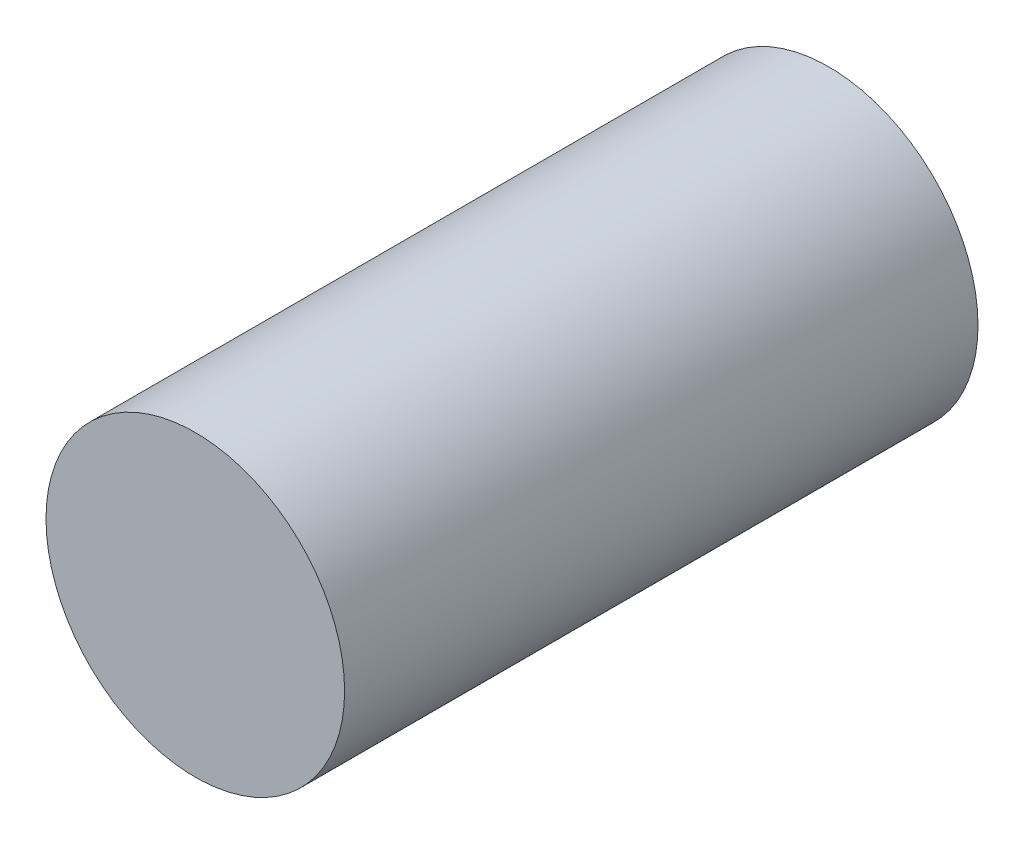
ISO-10303-21;
HEADER;
FILE_DESCRIPTION(('STEP AP214'),'2;1');
FILE_NAME('part.step','',(''),(''),'','','');
FILE_SCHEMA(('AUTOMOTIVE_DESIGN { 1 0 10303 214 1 1 1 1 }'));
ENDSEC;
DATA;
#1=APPLICATION_CONTEXT('core data for automotive mechanical design processes');
#2=APPLICATION_PROTOCOL_DEFINITION('international standard','automotive_design',2000,#1);
#3=PRODUCT_CONTEXT('',#1,'mechanical');
#4=PRODUCT('Part','Part','',(#3));
#5=PRODUCT_RELATED_PRODUCT_CATEGORY('part','',(#4));
#6=PRODUCT_DEFINITION_FORMATION('','',#4);
#7=PRODUCT_DEFINITION_CONTEXT('part definition',#1,'design');
#8=PRODUCT_DEFINITION('design','',#6,#7);
#9=PRODUCT_DEFINITION_SHAPE('','',#8);
#10=(LENGTH_UNIT() NAMED_UNIT(*) SI_UNIT(.MILLI.,.METRE.));
#11=(NAMED_UNIT(*) PLANE_ANGLE_UNIT() SI_UNIT($,.RADIAN.));
#12=(NAMED_UNIT(*) SI_UNIT($,.STERADIAN.) SOLID_ANGLE_UNIT());
#13=UNCERTAINTY_MEASURE_WITH_UNIT(LENGTH_MEASURE(1.E-05),#10,'distance_accuracy_value','');
#14=(GEOMETRIC_REPRESENTATION_CONTEXT(3) GLOBAL_UNCERTAINTY_ASSIGNED_CONTEXT((#13)) GLOBAL_UNIT_ASSIGNED_CONTEXT((#10,
#11,#12)) REPRESENTATION_CONTEXT('',''));
#15=CARTESIAN_POINT('',(0.,0.,0.));
#16=DIRECTION('',(0.,0.,1.));
#17=DIRECTION('',(1.,0.,0.));
#18=AXIS2_PLACEMENT_3D('',#15,#16,#17);
#19=CARTESIAN_POINT('',(0.,0.,70.));
#20=DIRECTION('',(0.,0.,-1.));
#21=DIRECTION('',(-1.,0.,0.));
#22=AXIS2_PLACEMENT_3D('',#19,#20,#21);
#23=CYLINDRICAL_SURFACE('',#22,16.5);
#24=CARTESIAN_POINT('',(0.,0.,70.));
#25=DIRECTION('',(0.,0.,1.));
#26=DIRECTION('',(1.,0.,0.));
#27=AXIS2_PLACEMENT_3D('',#24,#25,#26);
#28=CIRCLE('',#27,16.5);
#29=CARTESIAN_POINT('',(16.5,0.,70.));
#30=VERTEX_POINT('',#29);
#31=EDGE_CURVE('E10',#30,#30,#28,.T.);
#32=ORIENTED_EDGE('',*,*,#31,.F.);
#33=EDGE_LOOP('',(#32));
#34=FACE_BOUND('',#33,.T.);
#35=CARTESIAN_POINT('',(0.,0.,0.));
#36=DIRECTION('',(0.,0.,1.));
#37=DIRECTION('',(1.,0.,0.));
#38=AXIS2_PLACEMENT_3D('',#35,#36,#37);
#39=CIRCLE('',#38,16.5);
#40=CARTESIAN_POINT('',(16.5,0.,0.));
#41=VERTEX_POINT('',#40);
#42=EDGE_CURVE('E35',#41,#41,#39,.T.);
#43=ORIENTED_EDGE('',*,*,#42,.T.);
#44=EDGE_LOOP('',(#43));
#45=FACE_BOUND('',#44,.T.);
#46=ADVANCED_FACE('F32',(#34,#45),#23,.T.);
#47=CARTESIAN_POINT('',(0.,0.,70.));
#48=DIRECTION('',(0.,0.,1.));
#49=DIRECTION('',(1.,0.,0.));
#50=AXIS2_PLACEMENT_3D('',#47,#48,#49);
#51=PLANE('',#50);
#52=ORIENTED_EDGE('',*,*,#31,.T.);
#53=EDGE_LOOP('',(#52));
#54=FACE_BOUND('',#53,.T.);
#55=ADVANCED_FACE('F47',(#54),#51,.T.);
#56=CARTESIAN_POINT('',(0.,0.,0.));
#57=DIRECTION('',(0.,0.,1.));
#58=DIRECTION('',(1.,0.,0.));
#59=AXIS2_PLACEMENT_3D('',#56,#57,#58);
#60=PLANE('',#59);
#61=ORIENTED_EDGE('',*,*,#42,.F.);
#62=EDGE_LOOP('',(#61));
#63=FACE_BOUND('',#62,.T.);
#64=ADVANCED_FACE('F45',(#63),#60,.F.);
#65=CLOSED_SHELL('',(#46,#55,#64));
#66=MANIFOLD_SOLID_BREP('B2',#65);
#67=ADVANCED_BREP_SHAPE_REPRESENTATION('',(#18,#66),#14);
#68=SHAPE_DEFINITION_REPRESENTATION(#9,#67);
ENDSEC;
END-ISO-10303-21;
